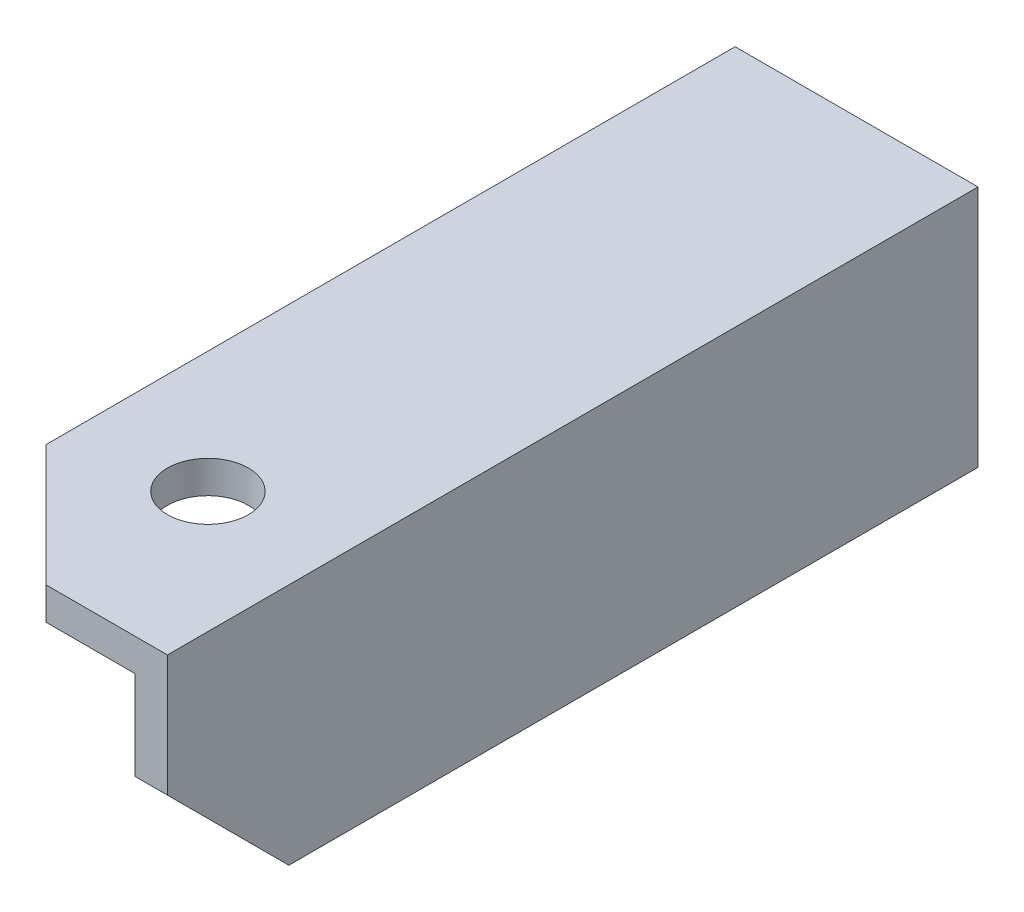
ISO-10303-21;
HEADER;
FILE_DESCRIPTION(('STEP AP214'),'2;1');
FILE_NAME('part.step','',(''),(''),'','','');
FILE_SCHEMA(('AUTOMOTIVE_DESIGN { 1 0 10303 214 1 1 1 1 }'));
ENDSEC;
DATA;
#1=APPLICATION_CONTEXT('core data for automotive mechanical design processes');
#2=APPLICATION_PROTOCOL_DEFINITION('international standard','automotive_design',2000,#1);
#3=PRODUCT_CONTEXT('',#1,'mechanical');
#4=PRODUCT('Part','Part','',(#3));
#5=PRODUCT_RELATED_PRODUCT_CATEGORY('part','',(#4));
#6=PRODUCT_DEFINITION_FORMATION('','',#4);
#7=PRODUCT_DEFINITION_CONTEXT('part definition',#1,'design');
#8=PRODUCT_DEFINITION('design','',#6,#7);
#9=PRODUCT_DEFINITION_SHAPE('','',#8);
#10=(LENGTH_UNIT() NAMED_UNIT(*) SI_UNIT(.MILLI.,.METRE.));
#11=(NAMED_UNIT(*) PLANE_ANGLE_UNIT() SI_UNIT($,.RADIAN.));
#12=(NAMED_UNIT(*) SI_UNIT($,.STERADIAN.) SOLID_ANGLE_UNIT());
#13=UNCERTAINTY_MEASURE_WITH_UNIT(LENGTH_MEASURE(1.E-05),#10,'distance_accuracy_value','');
#14=(GEOMETRIC_REPRESENTATION_CONTEXT(3) GLOBAL_UNCERTAINTY_ASSIGNED_CONTEXT((#13)) GLOBAL_UNIT_ASSIGNED_CONTEXT((#10,
#11,#12)) REPRESENTATION_CONTEXT('',''));
#15=CARTESIAN_POINT('',(0.,0.,0.));
#16=DIRECTION('',(0.,0.,1.));
#17=DIRECTION('',(1.,0.,0.));
#18=AXIS2_PLACEMENT_3D('',#15,#16,#17);
#19=CARTESIAN_POINT('',(-1.75,647.65,-11.0990731963808));
#20=DIRECTION('',(0.,1.,0.));
#21=DIRECTION('',(-1.,0.,0.));
#22=AXIS2_PLACEMENT_3D('',#19,#20,#21);
#23=PLANE('',#22);
#24=DIRECTION('',(0.707106781186547,0.,0.707106781186548));
#25=VECTOR('',#24,1.);
#26=CARTESIAN_POINT('',(-59.9999999999998,647.65,4.99999999999989));
#27=LINE('',#26,#25);
#28=CARTESIAN_POINT('',(-59.9999999999998,647.65,4.99999999999989));
#29=VERTEX_POINT('',#28);
#30=CARTESIAN_POINT('',(-44.9999999999998,647.65,19.9999999999999));
#31=VERTEX_POINT('',#30);
#32=EDGE_CURVE('E183',#29,#31,#27,.T.);
#33=ORIENTED_EDGE('',*,*,#32,.T.);
#34=DIRECTION('',(-1.,0.,0.));
#35=VECTOR('',#34,1.);
#36=CARTESIAN_POINT('',(-33.9999999999998,647.65,19.9999999999999));
#37=LINE('',#36,#35);
#38=CARTESIAN_POINT('',(-29.9999999999998,647.65,19.9999999999999));
#39=VERTEX_POINT('',#38);
#40=EDGE_CURVE('E123',#39,#31,#37,.T.);
#41=ORIENTED_EDGE('',*,*,#40,.F.);
#42=DIRECTION('',(0.,0.,1.));
#43=VECTOR('',#42,1.);
#44=CARTESIAN_POINT('',(-29.9999999999998,647.65,19.9999999999999));
#45=LINE('',#44,#43);
#46=CARTESIAN_POINT('',(-29.9999999999998,647.65,-80.1201360343224));
#47=VERTEX_POINT('',#46);
#48=EDGE_CURVE('E120',#47,#39,#45,.T.);
#49=ORIENTED_EDGE('',*,*,#48,.F.);
#50=DIRECTION('',(1.,0.,0.));
#51=VECTOR('',#50,1.);
#52=CARTESIAN_POINT('',(-29.9999999999998,647.65,-80.1201360343224));
#53=LINE('',#52,#51);
#54=CARTESIAN_POINT('',(-59.9999999999998,647.65,-80.1201360343224));
#55=VERTEX_POINT('',#54);
#56=EDGE_CURVE('E12',#47,#55,#53,.F.);
#57=ORIENTED_EDGE('',*,*,#56,.T.);
#58=DIRECTION('',(0.,0.,1.));
#59=VECTOR('',#58,1.);
#60=CARTESIAN_POINT('',(-59.9999999999998,647.65,-11.0990731963808));
#61=LINE('',#60,#59);
#62=EDGE_CURVE('E211',#55,#29,#61,.T.);
#63=ORIENTED_EDGE('',*,*,#62,.T.);
#64=EDGE_LOOP('',(#33,#41,#49,#57,#63));
#65=FACE_BOUND('',#64,.T.);
#66=CARTESIAN_POINT('',(-44.9999999999998,647.65,-1.01671635384947E-13));
#67=DIRECTION('',(0.,-1.,0.));
#68=DIRECTION('',(0.,0.,-1.));
#69=AXIS2_PLACEMENT_3D('',#66,#67,#68);
#70=CIRCLE('',#69,4.99999999999999);
#71=CARTESIAN_POINT('',(-44.9999999999998,647.65,-5.00000000000009));
#72=VERTEX_POINT('',#71);
#73=EDGE_CURVE('E137',#72,#72,#70,.T.);
#74=ORIENTED_EDGE('',*,*,#73,.T.);
#75=EDGE_LOOP('',(#74));
#76=FACE_BOUND('',#75,.T.);
#77=ADVANCED_FACE('F38',(#65,#76),#23,.T.);
#78=CARTESIAN_POINT('',(-52.4999999999998,647.65,12.4999999999999));
#79=DIRECTION('',(-0.707106781186548,0.,0.707106781186547));
#80=DIRECTION('',(0.707106781186547,0.,0.707106781186548));
#81=AXIS2_PLACEMENT_3D('',#78,#79,#80);
#82=PLANE('',#81);
#83=ORIENTED_EDGE('',*,*,#32,.F.);
#84=DIRECTION('',(0.,1.,0.));
#85=VECTOR('',#84,1.);
#86=CARTESIAN_POINT('',(-59.9999999999998,647.65,4.99999999999989));
#87=LINE('',#86,#85);
#88=CARTESIAN_POINT('',(-59.9999999999998,643.65,4.99999999999989));
#89=VERTEX_POINT('',#88);
#90=EDGE_CURVE('E42',#29,#89,#87,.F.);
#91=ORIENTED_EDGE('',*,*,#90,.T.);
#92=DIRECTION('',(0.707106781186547,0.,0.707106781186548));
#93=VECTOR('',#92,1.);
#94=CARTESIAN_POINT('',(-59.9999999999998,643.65,4.99999999999989));
#95=LINE('',#94,#93);
#96=CARTESIAN_POINT('',(-44.9999999999998,643.65,19.9999999999999));
#97=VERTEX_POINT('',#96);
#98=EDGE_CURVE('E184',#89,#97,#95,.T.);
#99=ORIENTED_EDGE('',*,*,#98,.T.);
#100=DIRECTION('',(0.,1.,0.));
#101=VECTOR('',#100,1.);
#102=CARTESIAN_POINT('',(-44.9999999999998,647.65,19.9999999999999));
#103=LINE('',#102,#101);
#104=EDGE_CURVE('E178',#97,#31,#103,.T.);
#105=ORIENTED_EDGE('',*,*,#104,.T.);
#106=EDGE_LOOP('',(#83,#91,#99,#105));
#107=FACE_BOUND('',#106,.T.);
#108=ADVANCED_FACE('F40',(#107),#82,.T.);
#109=CARTESIAN_POINT('',(-59.9999999999998,647.65,-52.1981463927615));
#110=DIRECTION('',(1.,0.,0.));
#111=DIRECTION('',(0.,0.,-1.));
#112=AXIS2_PLACEMENT_3D('',#109,#110,#111);
#113=PLANE('',#112);
#114=ORIENTED_EDGE('',*,*,#62,.F.);
#115=DIRECTION('',(0.,-1.,0.));
#116=VECTOR('',#115,1.);
#117=CARTESIAN_POINT('',(-59.9999999999998,647.65,-80.1201360343224));
#118=LINE('',#117,#116);
#119=CARTESIAN_POINT('',(-59.9999999999998,643.65,-80.1201360343224));
#120=VERTEX_POINT('',#119);
#121=EDGE_CURVE('E117',#55,#120,#118,.T.);
#122=ORIENTED_EDGE('',*,*,#121,.T.);
#123=DIRECTION('',(0.,0.,1.));
#124=VECTOR('',#123,1.);
#125=CARTESIAN_POINT('',(-59.9999999999998,643.65,-11.0990731963808));
#126=LINE('',#125,#124);
#127=EDGE_CURVE('E58',#120,#89,#126,.T.);
#128=ORIENTED_EDGE('',*,*,#127,.T.);
#129=ORIENTED_EDGE('',*,*,#90,.F.);
#130=EDGE_LOOP('',(#114,#122,#128,#129));
#131=FACE_BOUND('',#130,.T.);
#132=ADVANCED_FACE('F235',(#131),#113,.F.);
#133=CARTESIAN_POINT('',(-1.75,643.65,-11.0990731963808));
#134=DIRECTION('',(0.,1.,0.));
#135=DIRECTION('',(-1.,0.,0.));
#136=AXIS2_PLACEMENT_3D('',#133,#134,#135);
#137=PLANE('',#136);
#138=CARTESIAN_POINT('',(-44.9999999999998,643.65,-1.01671635384947E-13));
#139=DIRECTION('',(0.,-1.,0.));
#140=DIRECTION('',(0.,0.,-1.));
#141=AXIS2_PLACEMENT_3D('',#138,#139,#140);
#142=CIRCLE('',#141,4.99999999999999);
#143=CARTESIAN_POINT('',(-44.9999999999998,643.65,-5.00000000000009));
#144=VERTEX_POINT('',#143);
#145=EDGE_CURVE('E273',#144,#144,#142,.T.);
#146=ORIENTED_EDGE('',*,*,#145,.F.);
#147=EDGE_LOOP('',(#146));
#148=FACE_BOUND('',#147,.T.);
#149=DIRECTION('',(1.,0.,0.));
#150=VECTOR('',#149,1.);
#151=CARTESIAN_POINT('',(-29.9999999999998,643.65,-80.1201360343224));
#152=LINE('',#151,#150);
#153=CARTESIAN_POINT('',(-33.9999999999998,643.65,-80.1201360343224));
#154=VERTEX_POINT('',#153);
#155=EDGE_CURVE('E49',#120,#154,#152,.T.);
#156=ORIENTED_EDGE('',*,*,#155,.T.);
#157=DIRECTION('',(0.,0.,-1.));
#158=VECTOR('',#157,1.);
#159=CARTESIAN_POINT('',(-33.9999999999998,643.65,-80.1201360343224));
#160=LINE('',#159,#158);
#161=CARTESIAN_POINT('',(-33.9999999999998,643.65,19.9999999999999));
#162=VERTEX_POINT('',#161);
#163=EDGE_CURVE('E158',#162,#154,#160,.T.);
#164=ORIENTED_EDGE('',*,*,#163,.F.);
#165=DIRECTION('',(-1.,0.,0.));
#166=VECTOR('',#165,1.);
#167=CARTESIAN_POINT('',(-33.9999999999998,643.65,19.9999999999999));
#168=LINE('',#167,#166);
#169=EDGE_CURVE('E76',#162,#97,#168,.T.);
#170=ORIENTED_EDGE('',*,*,#169,.T.);
#171=ORIENTED_EDGE('',*,*,#98,.F.);
#172=ORIENTED_EDGE('',*,*,#127,.F.);
#173=EDGE_LOOP('',(#156,#164,#170,#171,#172));
#174=FACE_BOUND('',#173,.T.);
#175=ADVANCED_FACE('F234',(#148,#174),#137,.F.);
#176=CARTESIAN_POINT('',(-29.9999999999998,647.65,-80.1201360343224));
#177=DIRECTION('',(0.,0.,1.));
#178=DIRECTION('',(0.,-1.,0.));
#179=AXIS2_PLACEMENT_3D('',#176,#177,#178);
#180=PLANE('',#179);
#181=ORIENTED_EDGE('',*,*,#56,.F.);
#182=DIRECTION('',(0.,1.,0.));
#183=VECTOR('',#182,1.);
#184=CARTESIAN_POINT('',(-29.9999999999998,647.65,-80.1201360343224));
#185=LINE('',#184,#183);
#186=CARTESIAN_POINT('',(-29.9999999999998,617.65,-80.1201360343224));
#187=VERTEX_POINT('',#186);
#188=EDGE_CURVE('E115',#187,#47,#185,.T.);
#189=ORIENTED_EDGE('',*,*,#188,.F.);
#190=DIRECTION('',(-1.,0.,0.));
#191=VECTOR('',#190,1.);
#192=CARTESIAN_POINT('',(-29.9999999999998,617.65,-80.1201360343224));
#193=LINE('',#192,#191);
#194=CARTESIAN_POINT('',(-33.9999999999998,617.65,-80.1201360343224));
#195=VERTEX_POINT('',#194);
#196=EDGE_CURVE('E144',#187,#195,#193,.T.);
#197=ORIENTED_EDGE('',*,*,#196,.T.);
#198=DIRECTION('',(0.,1.,0.));
#199=VECTOR('',#198,1.);
#200=CARTESIAN_POINT('',(-33.9999999999998,647.65,-80.1201360343224));
#201=LINE('',#200,#199);
#202=EDGE_CURVE('E145',#195,#154,#201,.T.);
#203=ORIENTED_EDGE('',*,*,#202,.T.);
#204=ORIENTED_EDGE('',*,*,#155,.F.);
#205=ORIENTED_EDGE('',*,*,#121,.F.);
#206=EDGE_LOOP('',(#181,#189,#197,#203,#204,#205));
#207=FACE_BOUND('',#206,.T.);
#208=ADVANCED_FACE('F112',(#207),#180,.F.);
#209=CARTESIAN_POINT('',(-33.9999999999998,643.65,19.9999999999999));
#210=DIRECTION('',(0.,0.,-1.));
#211=DIRECTION('',(-1.,0.,0.));
#212=AXIS2_PLACEMENT_3D('',#209,#210,#211);
#213=PLANE('',#212);
#214=ORIENTED_EDGE('',*,*,#104,.F.);
#215=ORIENTED_EDGE('',*,*,#169,.F.);
#216=DIRECTION('',(0.,-1.,0.));
#217=VECTOR('',#216,1.);
#218=CARTESIAN_POINT('',(-33.9999999999998,632.65,19.9999999999999));
#219=LINE('',#218,#217);
#220=CARTESIAN_POINT('',(-33.9999999999998,632.65,19.9999999999999));
#221=VERTEX_POINT('',#220);
#222=EDGE_CURVE('E148',#162,#221,#219,.T.);
#223=ORIENTED_EDGE('',*,*,#222,.T.);
#224=DIRECTION('',(-1.,0.,0.));
#225=VECTOR('',#224,1.);
#226=CARTESIAN_POINT('',(-29.9999999999998,632.65,19.9999999999999));
#227=LINE('',#226,#225);
#228=CARTESIAN_POINT('',(-29.9999999999998,632.65,19.9999999999999));
#229=VERTEX_POINT('',#228);
#230=EDGE_CURVE('E155',#229,#221,#227,.T.);
#231=ORIENTED_EDGE('',*,*,#230,.F.);
#232=DIRECTION('',(0.,-1.,0.));
#233=VECTOR('',#232,1.);
#234=CARTESIAN_POINT('',(-29.9999999999998,632.65,19.9999999999999));
#235=LINE('',#234,#233);
#236=EDGE_CURVE('E126',#39,#229,#235,.T.);
#237=ORIENTED_EDGE('',*,*,#236,.F.);
#238=ORIENTED_EDGE('',*,*,#40,.T.);
#239=EDGE_LOOP('',(#214,#215,#223,#231,#237,#238));
#240=FACE_BOUND('',#239,.T.);
#241=ADVANCED_FACE('F220',(#240),#213,.F.);
#242=CARTESIAN_POINT('',(-29.9999999999998,617.65,4.99999999999991));
#243=DIRECTION('',(0.,0.707106781186547,-0.707106781186548));
#244=DIRECTION('',(0.,0.707106781186548,0.707106781186547));
#245=AXIS2_PLACEMENT_3D('',#242,#243,#244);
#246=PLANE('',#245);
#247=DIRECTION('',(0.,-0.707106781186548,-0.707106781186547));
#248=VECTOR('',#247,1.);
#249=CARTESIAN_POINT('',(-33.9999999999998,617.65,4.99999999999991));
#250=LINE('',#249,#248);
#251=CARTESIAN_POINT('',(-33.9999999999998,617.65,4.99999999999991));
#252=VERTEX_POINT('',#251);
#253=EDGE_CURVE('E134',#221,#252,#250,.T.);
#254=ORIENTED_EDGE('',*,*,#253,.T.);
#255=DIRECTION('',(-1.,0.,0.));
#256=VECTOR('',#255,1.);
#257=CARTESIAN_POINT('',(-29.9999999999998,617.65,4.99999999999991));
#258=LINE('',#257,#256);
#259=CARTESIAN_POINT('',(-29.9999999999998,617.65,4.99999999999991));
#260=VERTEX_POINT('',#259);
#261=EDGE_CURVE('E152',#260,#252,#258,.T.);
#262=ORIENTED_EDGE('',*,*,#261,.F.);
#263=DIRECTION('',(0.,-0.707106781186548,-0.707106781186547));
#264=VECTOR('',#263,1.);
#265=CARTESIAN_POINT('',(-29.9999999999998,617.65,4.99999999999991));
#266=LINE('',#265,#264);
#267=EDGE_CURVE('E141',#229,#260,#266,.T.);
#268=ORIENTED_EDGE('',*,*,#267,.F.);
#269=ORIENTED_EDGE('',*,*,#230,.T.);
#270=EDGE_LOOP('',(#254,#262,#268,#269));
#271=FACE_BOUND('',#270,.T.);
#272=ADVANCED_FACE('F225',(#271),#246,.F.);
#273=CARTESIAN_POINT('',(-29.9999999999998,617.65,-80.1201360343224));
#274=DIRECTION('',(0.,1.,0.));
#275=DIRECTION('',(0.,0.,1.));
#276=AXIS2_PLACEMENT_3D('',#273,#274,#275);
#277=PLANE('',#276);
#278=DIRECTION('',(0.,0.,-1.));
#279=VECTOR('',#278,1.);
#280=CARTESIAN_POINT('',(-33.9999999999998,617.65,-80.1201360343224));
#281=LINE('',#280,#279);
#282=EDGE_CURVE('E132',#252,#195,#281,.T.);
#283=ORIENTED_EDGE('',*,*,#282,.T.);
#284=ORIENTED_EDGE('',*,*,#196,.F.);
#285=DIRECTION('',(0.,0.,-1.));
#286=VECTOR('',#285,1.);
#287=CARTESIAN_POINT('',(-29.9999999999998,617.65,-80.1201360343224));
#288=LINE('',#287,#286);
#289=EDGE_CURVE('E130',#260,#187,#288,.T.);
#290=ORIENTED_EDGE('',*,*,#289,.F.);
#291=ORIENTED_EDGE('',*,*,#261,.T.);
#292=EDGE_LOOP('',(#283,#284,#290,#291));
#293=FACE_BOUND('',#292,.T.);
#294=ADVANCED_FACE('F229',(#293),#277,.F.);
#295=CARTESIAN_POINT('',(-29.9999999999998,0.,0.));
#296=DIRECTION('',(-1.,0.,0.));
#297=DIRECTION('',(0.,0.,1.));
#298=AXIS2_PLACEMENT_3D('',#295,#296,#297);
#299=PLANE('',#298);
#300=ORIENTED_EDGE('',*,*,#188,.T.);
#301=ORIENTED_EDGE('',*,*,#48,.T.);
#302=ORIENTED_EDGE('',*,*,#236,.T.);
#303=ORIENTED_EDGE('',*,*,#267,.T.);
#304=ORIENTED_EDGE('',*,*,#289,.T.);
#305=EDGE_LOOP('',(#300,#301,#302,#303,#304));
#306=FACE_BOUND('',#305,.T.);
#307=ADVANCED_FACE('F128',(#306),#299,.F.);
#308=CARTESIAN_POINT('',(-33.9999999999998,0.,0.));
#309=DIRECTION('',(-1.,0.,0.));
#310=DIRECTION('',(0.,0.,1.));
#311=AXIS2_PLACEMENT_3D('',#308,#309,#310);
#312=PLANE('',#311);
#313=ORIENTED_EDGE('',*,*,#222,.F.);
#314=ORIENTED_EDGE('',*,*,#163,.T.);
#315=ORIENTED_EDGE('',*,*,#202,.F.);
#316=ORIENTED_EDGE('',*,*,#282,.F.);
#317=ORIENTED_EDGE('',*,*,#253,.F.);
#318=EDGE_LOOP('',(#313,#314,#315,#316,#317));
#319=FACE_BOUND('',#318,.T.);
#320=ADVANCED_FACE('F233',(#319),#312,.T.);
#321=CARTESIAN_POINT('',(-44.9999999999998,643.65,-1.01671635384947E-13));
#322=DIRECTION('',(0.,-1.,0.));
#323=DIRECTION('',(0.,0.,-1.));
#324=AXIS2_PLACEMENT_3D('',#321,#322,#323);
#325=CYLINDRICAL_SURFACE('',#324,4.99999999999999);
#326=ORIENTED_EDGE('',*,*,#73,.F.);
#327=EDGE_LOOP('',(#326));
#328=FACE_BOUND('',#327,.T.);
#329=ORIENTED_EDGE('',*,*,#145,.T.);
#330=EDGE_LOOP('',(#329));
#331=FACE_BOUND('',#330,.T.);
#332=ADVANCED_FACE('F261',(#328,#331),#325,.F.);
#333=CLOSED_SHELL('',(#77,#108,#132,#175,#208,#241,#272,#294,#307,#320,#332));
#334=MANIFOLD_SOLID_BREP('B2',#333);
#335=ADVANCED_BREP_SHAPE_REPRESENTATION('',(#18,#334),#14);
#336=SHAPE_DEFINITION_REPRESENTATION(#9,#335);
ENDSEC;
END-ISO-10303-21;
